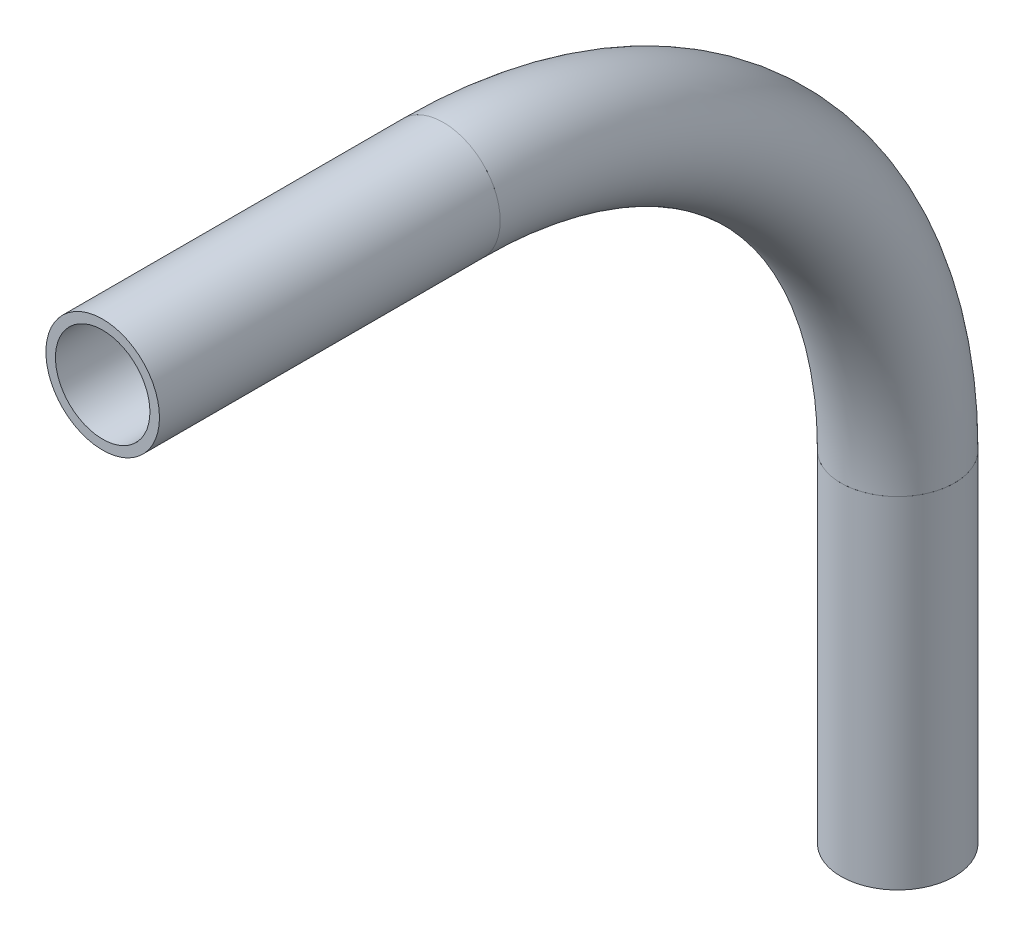
ISO-10303-21;
HEADER;
FILE_DESCRIPTION(('STEP AP214'),'2;1');
FILE_NAME('part.step','',(''),(''),'','','');
FILE_SCHEMA(('AUTOMOTIVE_DESIGN { 1 0 10303 214 1 1 1 1 }'));
ENDSEC;
DATA;
#1=APPLICATION_CONTEXT('core data for automotive mechanical design processes');
#2=APPLICATION_PROTOCOL_DEFINITION('international standard','automotive_design',2000,#1);
#3=PRODUCT_CONTEXT('',#1,'mechanical');
#4=PRODUCT('Part','Part','',(#3));
#5=PRODUCT_RELATED_PRODUCT_CATEGORY('part','',(#4));
#6=PRODUCT_DEFINITION_FORMATION('','',#4);
#7=PRODUCT_DEFINITION_CONTEXT('part definition',#1,'design');
#8=PRODUCT_DEFINITION('design','',#6,#7);
#9=PRODUCT_DEFINITION_SHAPE('','',#8);
#10=(LENGTH_UNIT() NAMED_UNIT(*) SI_UNIT(.MILLI.,.METRE.));
#11=(NAMED_UNIT(*) PLANE_ANGLE_UNIT() SI_UNIT($,.RADIAN.));
#12=(NAMED_UNIT(*) SI_UNIT($,.STERADIAN.) SOLID_ANGLE_UNIT());
#13=UNCERTAINTY_MEASURE_WITH_UNIT(LENGTH_MEASURE(1.E-05),#10,'distance_accuracy_value','');
#14=(GEOMETRIC_REPRESENTATION_CONTEXT(3) GLOBAL_UNCERTAINTY_ASSIGNED_CONTEXT((#13)) GLOBAL_UNIT_ASSIGNED_CONTEXT((#10,
#11,#12)) REPRESENTATION_CONTEXT('',''));
#15=CARTESIAN_POINT('',(0.,0.,0.));
#16=DIRECTION('',(0.,0.,1.));
#17=DIRECTION('',(1.,0.,0.));
#18=AXIS2_PLACEMENT_3D('',#15,#16,#17);
#19=CARTESIAN_POINT('',(0.,-256.524515022597,325.471235238798));
#20=DIRECTION('',(0.,0.,1.));
#21=DIRECTION('',(1.,0.,0.));
#22=AXIS2_PLACEMENT_3D('',#19,#20,#21);
#23=CYLINDRICAL_SURFACE('',#22,5.2832);
#24=CARTESIAN_POINT('',(0.,-256.524515022597,363.571235238798));
#25=DIRECTION('',(0.,0.,-1.));
#26=DIRECTION('',(1.,0.,0.));
#27=AXIS2_PLACEMENT_3D('',#24,#25,#26);
#28=CIRCLE('',#27,5.2832);
#29=CARTESIAN_POINT('',(5.2832,-256.524515022597,363.571235238798));
#30=VERTEX_POINT('',#29);
#31=EDGE_CURVE('E66',#30,#30,#28,.T.);
#32=ORIENTED_EDGE('',*,*,#31,.F.);
#33=EDGE_LOOP('',(#32));
#34=FACE_BOUND('',#33,.T.);
#35=CARTESIAN_POINT('',(0.,-256.524515022597,325.471235238798));
#36=DIRECTION('',(0.,0.,-1.));
#37=DIRECTION('',(0.,1.,0.));
#38=AXIS2_PLACEMENT_3D('',#35,#36,#37);
#39=CIRCLE('',#38,5.2832);
#40=CARTESIAN_POINT('',(0.,-251.241315022597,325.471235238798));
#41=VERTEX_POINT('',#40);
#42=EDGE_CURVE('E62',#41,#41,#39,.T.);
#43=ORIENTED_EDGE('',*,*,#42,.T.);
#44=EDGE_LOOP('',(#43));
#45=FACE_BOUND('',#44,.T.);
#46=ADVANCED_FACE('F58',(#34,#45),#23,.F.);
#47=CARTESIAN_POINT('',(0.,-256.524515022597,325.471235238798));
#48=DIRECTION('',(0.,0.,1.));
#49=DIRECTION('',(1.,0.,0.));
#50=AXIS2_PLACEMENT_3D('',#47,#48,#49);
#51=CYLINDRICAL_SURFACE('',#50,6.35);
#52=CARTESIAN_POINT('',(0.,-256.524515022597,363.571235238798));
#53=DIRECTION('',(0.,0.,-1.));
#54=DIRECTION('',(1.,0.,0.));
#55=AXIS2_PLACEMENT_3D('',#52,#53,#54);
#56=CIRCLE('',#55,6.35);
#57=CARTESIAN_POINT('',(6.35,-256.524515022597,363.571235238798));
#58=VERTEX_POINT('',#57);
#59=EDGE_CURVE('E70',#58,#58,#56,.T.);
#60=ORIENTED_EDGE('',*,*,#59,.T.);
#61=EDGE_LOOP('',(#60));
#62=FACE_BOUND('',#61,.T.);
#63=CARTESIAN_POINT('',(0.,-256.524515022597,325.471235238798));
#64=DIRECTION('',(0.,0.,-1.));
#65=DIRECTION('',(0.,1.,0.));
#66=AXIS2_PLACEMENT_3D('',#63,#64,#65);
#67=CIRCLE('',#66,6.35);
#68=CARTESIAN_POINT('',(0.,-250.174515022597,325.471235238798));
#69=VERTEX_POINT('',#68);
#70=EDGE_CURVE('E14',#69,#69,#67,.T.);
#71=ORIENTED_EDGE('',*,*,#70,.F.);
#72=EDGE_LOOP('',(#71));
#73=FACE_BOUND('',#72,.T.);
#74=ADVANCED_FACE('F85',(#62,#73),#51,.T.);
#75=CARTESIAN_POINT('',(0.,-256.524515022597,363.571235238798));
#76=DIRECTION('',(0.,0.,-1.));
#77=DIRECTION('',(1.,0.,0.));
#78=AXIS2_PLACEMENT_3D('',#75,#76,#77);
#79=PLANE('',#78);
#80=ORIENTED_EDGE('',*,*,#31,.T.);
#81=EDGE_LOOP('',(#80));
#82=FACE_BOUND('',#81,.T.);
#83=ORIENTED_EDGE('',*,*,#59,.F.);
#84=EDGE_LOOP('',(#83));
#85=FACE_BOUND('',#84,.T.);
#86=ADVANCED_FACE('F81',(#82,#85),#79,.F.);
#87=CARTESIAN_POINT('',(0.,-256.524515022597,325.471235238798));
#88=DIRECTION('',(0.,0.,-1.));
#89=DIRECTION('',(0.,1.,0.));
#90=AXIS2_PLACEMENT_3D('',#87,#88,#89);
#91=PLANE('',#90);
#92=ORIENTED_EDGE('',*,*,#42,.F.);
#93=EDGE_LOOP('',(#92));
#94=FACE_BOUND('',#93,.T.);
#95=ORIENTED_EDGE('',*,*,#70,.T.);
#96=EDGE_LOOP('',(#95));
#97=FACE_BOUND('',#96,.T.);
#98=ADVANCED_FACE('F60',(#94,#97),#91,.T.);
#99=CLOSED_SHELL('',(#46,#74,#86,#98));
#100=MANIFOLD_SOLID_BREP('B2',#99);
#101=CARTESIAN_POINT('',(0.,-307.324515022597,325.471235238798));
#102=DIRECTION('',(1.,0.,0.));
#103=DIRECTION('',(0.,0.,-1.));
#104=AXIS2_PLACEMENT_3D('',#101,#102,#103);
#105=TOROIDAL_SURFACE('',#104,50.8,5.2832);
#106=CARTESIAN_POINT('',(0.,-307.324515022597,274.671235238798));
#107=DIRECTION('',(0.,-1.,0.));
#108=DIRECTION('',(0.,0.,-1.));
#109=AXIS2_PLACEMENT_3D('',#106,#107,#108);
#110=CIRCLE('',#109,5.2832);
#111=CARTESIAN_POINT('',(0.,-307.324515022597,269.388035238798));
#112=VERTEX_POINT('',#111);
#113=EDGE_CURVE('E161',#112,#112,#110,.T.);
#114=CARTESIAN_POINT('',(0.,-256.524515022597,325.471235238799));
#115=DIRECTION('',(0.,0.,1.));
#116=DIRECTION('',(0.,-1.,0.));
#117=AXIS2_PLACEMENT_3D('',#114,#115,#116);
#118=CIRCLE('',#117,5.2832);
#119=CARTESIAN_POINT('',(0.,-251.241315022597,325.471235238799));
#120=VERTEX_POINT('',#119);
#121=EDGE_CURVE('E151',#120,#120,#118,.T.);
#122=CARTESIAN_POINT('',(0.,-307.324515022597,325.471235238798));
#123=DIRECTION('',(1.,0.,0.));
#124=DIRECTION('',(0.,0.,-1.));
#125=AXIS2_PLACEMENT_3D('',#122,#123,#124);
#126=CIRCLE('',#125,56.0832);
#127=EDGE_CURVE('',#112,#120,#126,.T.);
#128=ORIENTED_EDGE('',*,*,#113,.T.);
#129=ORIENTED_EDGE('',*,*,#121,.T.);
#130=ORIENTED_EDGE('',*,*,#127,.T.);
#131=ORIENTED_EDGE('',*,*,#127,.F.);
#132=EDGE_LOOP('',(#128,#130,#129,#131));
#133=FACE_BOUND('',#132,.T.);
#134=ADVANCED_FACE('F147',(#133),#105,.F.);
#135=CARTESIAN_POINT('',(0.,-307.324515022597,325.471235238798));
#136=DIRECTION('',(1.,0.,0.));
#137=DIRECTION('',(0.,0.,-1.));
#138=AXIS2_PLACEMENT_3D('',#135,#136,#137);
#139=TOROIDAL_SURFACE('',#138,50.8,6.35);
#140=CARTESIAN_POINT('',(0.,-307.324515022597,274.671235238798));
#141=DIRECTION('',(0.,-1.,0.));
#142=DIRECTION('',(0.,0.,-1.));
#143=AXIS2_PLACEMENT_3D('',#140,#141,#142);
#144=CIRCLE('',#143,6.35);
#145=CARTESIAN_POINT('',(0.,-307.324515022597,268.321235238798));
#146=VERTEX_POINT('',#145);
#147=EDGE_CURVE('E155',#146,#146,#144,.T.);
#148=CARTESIAN_POINT('',(0.,-256.524515022597,325.471235238799));
#149=DIRECTION('',(0.,0.,1.));
#150=DIRECTION('',(0.,-1.,0.));
#151=AXIS2_PLACEMENT_3D('',#148,#149,#150);
#152=CIRCLE('',#151,6.35);
#153=CARTESIAN_POINT('',(0.,-250.174515022597,325.471235238799));
#154=VERTEX_POINT('',#153);
#155=EDGE_CURVE('E57',#154,#154,#152,.T.);
#156=CARTESIAN_POINT('',(0.,-307.324515022597,325.471235238798));
#157=DIRECTION('',(1.,0.,0.));
#158=DIRECTION('',(0.,0.,-1.));
#159=AXIS2_PLACEMENT_3D('',#156,#157,#158);
#160=CIRCLE('',#159,57.1499999999999);
#161=EDGE_CURVE('',#146,#154,#160,.T.);
#162=ORIENTED_EDGE('',*,*,#147,.F.);
#163=ORIENTED_EDGE('',*,*,#155,.F.);
#164=ORIENTED_EDGE('',*,*,#161,.T.);
#165=ORIENTED_EDGE('',*,*,#161,.F.);
#166=EDGE_LOOP('',(#162,#164,#163,#165));
#167=FACE_BOUND('',#166,.T.);
#168=ADVANCED_FACE('F174',(#167),#139,.T.);
#169=CARTESIAN_POINT('',(0.,-307.324515022598,274.671235238798));
#170=DIRECTION('',(0.,-1.,0.));
#171=DIRECTION('',(0.,0.,-1.));
#172=AXIS2_PLACEMENT_3D('',#169,#170,#171);
#173=PLANE('',#172);
#174=ORIENTED_EDGE('',*,*,#113,.F.);
#175=EDGE_LOOP('',(#174));
#176=FACE_BOUND('',#175,.T.);
#177=ORIENTED_EDGE('',*,*,#147,.T.);
#178=EDGE_LOOP('',(#177));
#179=FACE_BOUND('',#178,.T.);
#180=ADVANCED_FACE('F170',(#176,#179),#173,.T.);
#181=CARTESIAN_POINT('',(0.,-256.524515022597,325.471235238798));
#182=DIRECTION('',(0.,0.,1.));
#183=DIRECTION('',(0.,-1.,0.));
#184=AXIS2_PLACEMENT_3D('',#181,#182,#183);
#185=PLANE('',#184);
#186=ORIENTED_EDGE('',*,*,#121,.F.);
#187=EDGE_LOOP('',(#186));
#188=FACE_BOUND('',#187,.T.);
#189=ORIENTED_EDGE('',*,*,#155,.T.);
#190=EDGE_LOOP('',(#189));
#191=FACE_BOUND('',#190,.T.);
#192=ADVANCED_FACE('F149',(#188,#191),#185,.T.);
#193=CLOSED_SHELL('',(#134,#168,#180,#192));
#194=MANIFOLD_SOLID_BREP('B9',#193);
#195=CARTESIAN_POINT('',(0.,-345.424515022597,274.671235238798));
#196=DIRECTION('',(0.,1.,0.));
#197=DIRECTION('',(0.,0.,1.));
#198=AXIS2_PLACEMENT_3D('',#195,#196,#197);
#199=CYLINDRICAL_SURFACE('',#198,5.2832);
#200=CARTESIAN_POINT('',(0.,-345.424515022597,274.671235238798));
#201=DIRECTION('',(0.,-1.,0.));
#202=DIRECTION('',(1.,0.,0.));
#203=AXIS2_PLACEMENT_3D('',#200,#201,#202);
#204=CIRCLE('',#203,5.2832);
#205=CARTESIAN_POINT('',(5.2832,-345.424515022597,274.671235238798));
#206=VERTEX_POINT('',#205);
#207=EDGE_CURVE('E243',#206,#206,#204,.T.);
#208=ORIENTED_EDGE('',*,*,#207,.T.);
#209=EDGE_LOOP('',(#208));
#210=FACE_BOUND('',#209,.T.);
#211=CARTESIAN_POINT('',(0.,-307.324515022598,274.671235238798));
#212=DIRECTION('',(0.,1.,0.));
#213=DIRECTION('',(0.,0.,1.));
#214=AXIS2_PLACEMENT_3D('',#211,#212,#213);
#215=CIRCLE('',#214,5.2832);
#216=CARTESIAN_POINT('',(0.,-307.324515022598,279.954435238798));
#217=VERTEX_POINT('',#216);
#218=EDGE_CURVE('E233',#217,#217,#215,.T.);
#219=ORIENTED_EDGE('',*,*,#218,.T.);
#220=EDGE_LOOP('',(#219));
#221=FACE_BOUND('',#220,.T.);
#222=ADVANCED_FACE('F229',(#210,#221),#199,.F.);
#223=CARTESIAN_POINT('',(0.,-345.424515022597,274.671235238798));
#224=DIRECTION('',(0.,1.,0.));
#225=DIRECTION('',(0.,0.,1.));
#226=AXIS2_PLACEMENT_3D('',#223,#224,#225);
#227=CYLINDRICAL_SURFACE('',#226,6.35);
#228=CARTESIAN_POINT('',(0.,-345.424515022597,274.671235238798));
#229=DIRECTION('',(0.,-1.,0.));
#230=DIRECTION('',(1.,0.,0.));
#231=AXIS2_PLACEMENT_3D('',#228,#229,#230);
#232=CIRCLE('',#231,6.35);
#233=CARTESIAN_POINT('',(6.35,-345.424515022597,274.671235238798));
#234=VERTEX_POINT('',#233);
#235=EDGE_CURVE('E237',#234,#234,#232,.T.);
#236=ORIENTED_EDGE('',*,*,#235,.F.);
#237=EDGE_LOOP('',(#236));
#238=FACE_BOUND('',#237,.T.);
#239=CARTESIAN_POINT('',(0.,-307.324515022598,274.671235238798));
#240=DIRECTION('',(0.,1.,0.));
#241=DIRECTION('',(0.,0.,1.));
#242=AXIS2_PLACEMENT_3D('',#239,#240,#241);
#243=CIRCLE('',#242,6.35);
#244=CARTESIAN_POINT('',(0.,-307.324515022598,281.021235238798));
#245=VERTEX_POINT('',#244);
#246=EDGE_CURVE('E146',#245,#245,#243,.T.);
#247=ORIENTED_EDGE('',*,*,#246,.F.);
#248=EDGE_LOOP('',(#247));
#249=FACE_BOUND('',#248,.T.);
#250=ADVANCED_FACE('F256',(#238,#249),#227,.T.);
#251=CARTESIAN_POINT('',(0.,-345.424515022597,274.671235238798));
#252=DIRECTION('',(0.,-1.,0.));
#253=DIRECTION('',(1.,0.,0.));
#254=AXIS2_PLACEMENT_3D('',#251,#252,#253);
#255=PLANE('',#254);
#256=ORIENTED_EDGE('',*,*,#207,.F.);
#257=EDGE_LOOP('',(#256));
#258=FACE_BOUND('',#257,.T.);
#259=ORIENTED_EDGE('',*,*,#235,.T.);
#260=EDGE_LOOP('',(#259));
#261=FACE_BOUND('',#260,.T.);
#262=ADVANCED_FACE('F252',(#258,#261),#255,.T.);
#263=CARTESIAN_POINT('',(0.,-307.324515022598,274.671235238798));
#264=DIRECTION('',(0.,1.,0.));
#265=DIRECTION('',(0.,0.,1.));
#266=AXIS2_PLACEMENT_3D('',#263,#264,#265);
#267=PLANE('',#266);
#268=ORIENTED_EDGE('',*,*,#218,.F.);
#269=EDGE_LOOP('',(#268));
#270=FACE_BOUND('',#269,.T.);
#271=ORIENTED_EDGE('',*,*,#246,.T.);
#272=EDGE_LOOP('',(#271));
#273=FACE_BOUND('',#272,.T.);
#274=ADVANCED_FACE('F231',(#270,#273),#267,.T.);
#275=CLOSED_SHELL('',(#222,#250,#262,#274));
#276=MANIFOLD_SOLID_BREP('B52',#275);
#277=ADVANCED_BREP_SHAPE_REPRESENTATION('',(#18,#100,#194,#276),#14);
#278=SHAPE_DEFINITION_REPRESENTATION(#9,#277);
ENDSEC;
END-ISO-10303-21;
